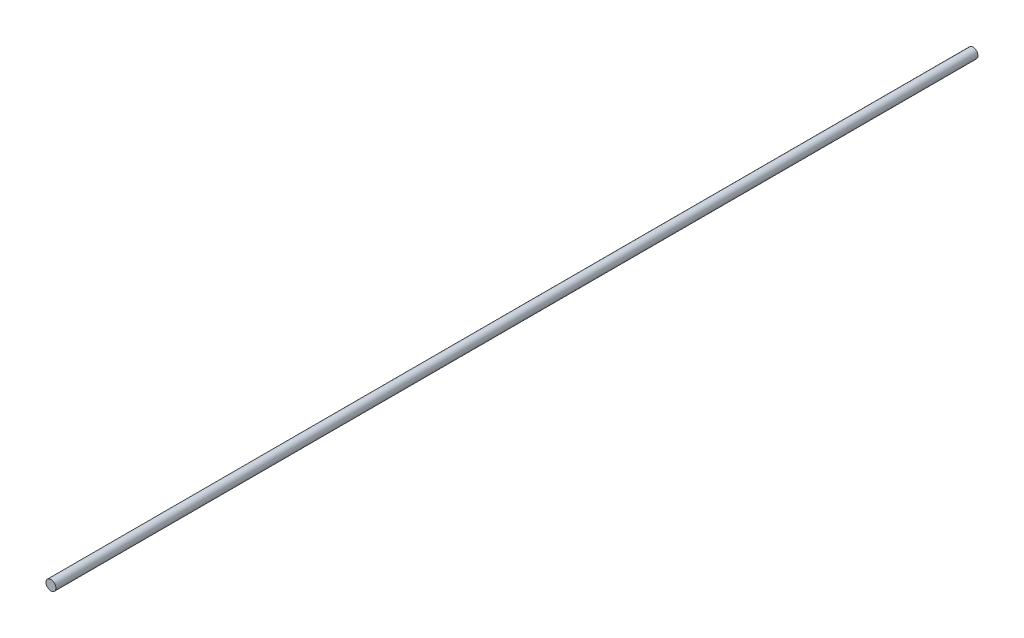
ISO-10303-21;
HEADER;
FILE_DESCRIPTION(('STEP AP214'),'2;1');
FILE_NAME('part.step','',(''),(''),'','','');
FILE_SCHEMA(('AUTOMOTIVE_DESIGN { 1 0 10303 214 1 1 1 1 }'));
ENDSEC;
DATA;
#1=APPLICATION_CONTEXT('core data for automotive mechanical design processes');
#2=APPLICATION_PROTOCOL_DEFINITION('international standard','automotive_design',2000,#1);
#3=PRODUCT_CONTEXT('',#1,'mechanical');
#4=PRODUCT('Part','Part','',(#3));
#5=PRODUCT_RELATED_PRODUCT_CATEGORY('part','',(#4));
#6=PRODUCT_DEFINITION_FORMATION('','',#4);
#7=PRODUCT_DEFINITION_CONTEXT('part definition',#1,'design');
#8=PRODUCT_DEFINITION('design','',#6,#7);
#9=PRODUCT_DEFINITION_SHAPE('','',#8);
#10=(LENGTH_UNIT() NAMED_UNIT(*) SI_UNIT(.MILLI.,.METRE.));
#11=(NAMED_UNIT(*) PLANE_ANGLE_UNIT() SI_UNIT($,.RADIAN.));
#12=(NAMED_UNIT(*) SI_UNIT($,.STERADIAN.) SOLID_ANGLE_UNIT());
#13=UNCERTAINTY_MEASURE_WITH_UNIT(LENGTH_MEASURE(1.E-05),#10,'distance_accuracy_value','');
#14=(GEOMETRIC_REPRESENTATION_CONTEXT(3) GLOBAL_UNCERTAINTY_ASSIGNED_CONTEXT((#13)) GLOBAL_UNIT_ASSIGNED_CONTEXT((#10,
#11,#12)) REPRESENTATION_CONTEXT('',''));
#15=CARTESIAN_POINT('',(0.,0.,0.));
#16=DIRECTION('',(0.,0.,1.));
#17=DIRECTION('',(1.,0.,0.));
#18=AXIS2_PLACEMENT_3D('',#15,#16,#17);
#19=CARTESIAN_POINT('',(0.,0.,279.));
#20=DIRECTION('',(0.,0.,-1.));
#21=DIRECTION('',(-1.,0.,0.));
#22=AXIS2_PLACEMENT_3D('',#19,#20,#21);
#23=CYLINDRICAL_SURFACE('',#22,1.5);
#24=CARTESIAN_POINT('',(0.,0.,279.));
#25=DIRECTION('',(0.,0.,1.));
#26=DIRECTION('',(1.,0.,0.));
#27=AXIS2_PLACEMENT_3D('',#24,#25,#26);
#28=CIRCLE('',#27,1.5);
#29=CARTESIAN_POINT('',(1.5,0.,279.));
#30=VERTEX_POINT('',#29);
#31=EDGE_CURVE('E10',#30,#30,#28,.T.);
#32=ORIENTED_EDGE('',*,*,#31,.F.);
#33=EDGE_LOOP('',(#32));
#34=FACE_BOUND('',#33,.T.);
#35=CARTESIAN_POINT('',(0.,0.,0.));
#36=DIRECTION('',(0.,0.,1.));
#37=DIRECTION('',(1.,0.,0.));
#38=AXIS2_PLACEMENT_3D('',#35,#36,#37);
#39=CIRCLE('',#38,1.5);
#40=CARTESIAN_POINT('',(1.5,0.,0.));
#41=VERTEX_POINT('',#40);
#42=EDGE_CURVE('E34',#41,#41,#39,.T.);
#43=ORIENTED_EDGE('',*,*,#42,.T.);
#44=EDGE_LOOP('',(#43));
#45=FACE_BOUND('',#44,.T.);
#46=ADVANCED_FACE('F31',(#34,#45),#23,.T.);
#47=CARTESIAN_POINT('',(0.,0.,279.));
#48=DIRECTION('',(0.,0.,1.));
#49=DIRECTION('',(1.,0.,0.));
#50=AXIS2_PLACEMENT_3D('',#47,#48,#49);
#51=PLANE('',#50);
#52=ORIENTED_EDGE('',*,*,#31,.T.);
#53=EDGE_LOOP('',(#52));
#54=FACE_BOUND('',#53,.T.);
#55=ADVANCED_FACE('F46',(#54),#51,.T.);
#56=CARTESIAN_POINT('',(0.,0.,0.));
#57=DIRECTION('',(0.,0.,1.));
#58=DIRECTION('',(1.,0.,0.));
#59=AXIS2_PLACEMENT_3D('',#56,#57,#58);
#60=PLANE('',#59);
#61=ORIENTED_EDGE('',*,*,#42,.F.);
#62=EDGE_LOOP('',(#61));
#63=FACE_BOUND('',#62,.T.);
#64=ADVANCED_FACE('F44',(#63),#60,.F.);
#65=CLOSED_SHELL('',(#46,#55,#64));
#66=MANIFOLD_SOLID_BREP('B2',#65);
#67=ADVANCED_BREP_SHAPE_REPRESENTATION('',(#18,#66),#14);
#68=SHAPE_DEFINITION_REPRESENTATION(#9,#67);
ENDSEC;
END-ISO-10303-21;
